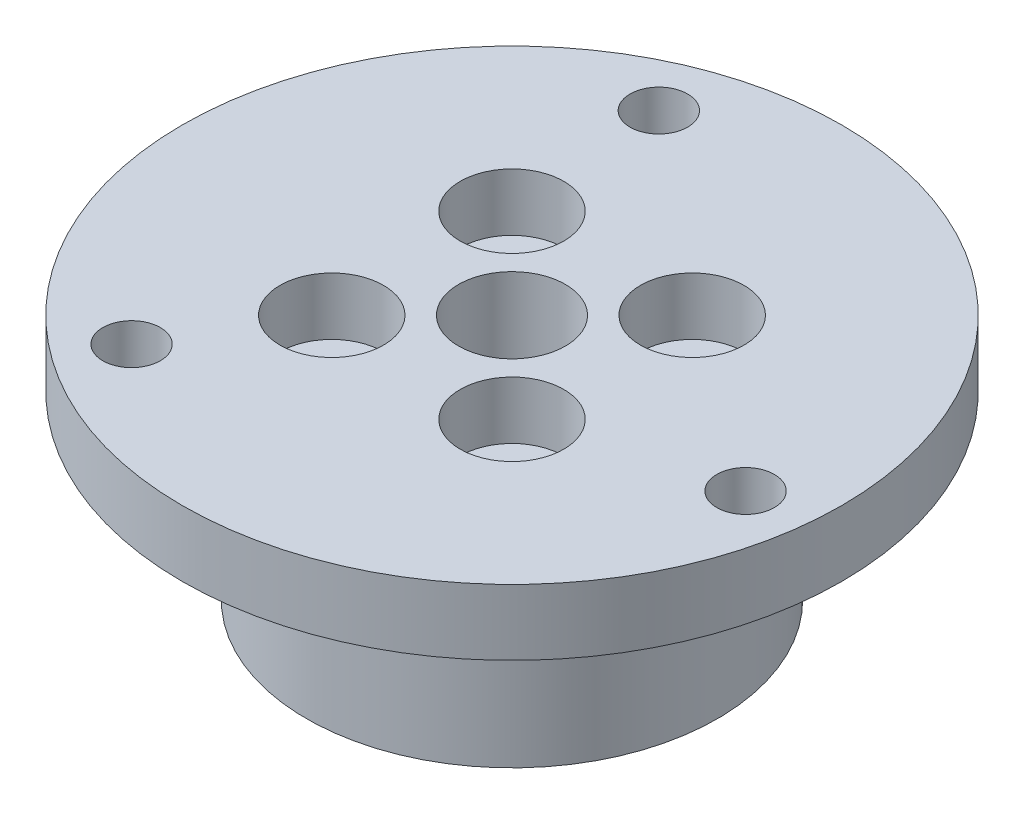
ISO-10303-21;
HEADER;
FILE_DESCRIPTION(('STEP AP214'),'2;1');
FILE_NAME('part.step','',(''),(''),'','','');
FILE_SCHEMA(('AUTOMOTIVE_DESIGN { 1 0 10303 214 1 1 1 1 }'));
ENDSEC;
DATA;
#1=APPLICATION_CONTEXT('core data for automotive mechanical design processes');
#2=APPLICATION_PROTOCOL_DEFINITION('international standard','automotive_design',2000,#1);
#3=PRODUCT_CONTEXT('',#1,'mechanical');
#4=PRODUCT('Part','Part','',(#3));
#5=PRODUCT_RELATED_PRODUCT_CATEGORY('part','',(#4));
#6=PRODUCT_DEFINITION_FORMATION('','',#4);
#7=PRODUCT_DEFINITION_CONTEXT('part definition',#1,'design');
#8=PRODUCT_DEFINITION('design','',#6,#7);
#9=PRODUCT_DEFINITION_SHAPE('','',#8);
#10=(LENGTH_UNIT() NAMED_UNIT(*) SI_UNIT(.MILLI.,.METRE.));
#11=(NAMED_UNIT(*) PLANE_ANGLE_UNIT() SI_UNIT($,.RADIAN.));
#12=(NAMED_UNIT(*) SI_UNIT($,.STERADIAN.) SOLID_ANGLE_UNIT());
#13=UNCERTAINTY_MEASURE_WITH_UNIT(LENGTH_MEASURE(1.E-05),#10,'distance_accuracy_value','');
#14=(GEOMETRIC_REPRESENTATION_CONTEXT(3) GLOBAL_UNCERTAINTY_ASSIGNED_CONTEXT((#13)) GLOBAL_UNIT_ASSIGNED_CONTEXT((#10,
#11,#12)) REPRESENTATION_CONTEXT('',''));
#15=CARTESIAN_POINT('',(0.,0.,0.));
#16=DIRECTION('',(0.,0.,1.));
#17=DIRECTION('',(1.,0.,0.));
#18=AXIS2_PLACEMENT_3D('',#15,#16,#17);
#19=CARTESIAN_POINT('',(16.3588402126679,15.,2.15368217163084));
#20=DIRECTION('',(0.,-1.,0.));
#21=DIRECTION('',(0.,0.,-1.));
#22=AXIS2_PLACEMENT_3D('',#19,#20,#21);
#23=CYLINDRICAL_SURFACE('',#22,1.75);
#24=CARTESIAN_POINT('',(16.3588402126679,15.,2.15368217163084));
#25=DIRECTION('',(0.,1.,0.));
#26=DIRECTION('',(0.,0.,1.));
#27=AXIS2_PLACEMENT_3D('',#24,#25,#26);
#28=CIRCLE('',#27,1.75);
#29=CARTESIAN_POINT('',(16.3588402126679,15.,3.90368217163084));
#30=VERTEX_POINT('',#29);
#31=EDGE_CURVE('E50',#30,#30,#28,.T.);
#32=ORIENTED_EDGE('',*,*,#31,.T.);
#33=EDGE_LOOP('',(#32));
#34=FACE_BOUND('',#33,.T.);
#35=CARTESIAN_POINT('',(16.3588402126679,11.,2.15368217163084));
#36=DIRECTION('',(0.,-1.,0.));
#37=DIRECTION('',(0.,0.,-1.));
#38=AXIS2_PLACEMENT_3D('',#35,#36,#37);
#39=CIRCLE('',#38,1.75);
#40=CARTESIAN_POINT('',(16.3588402126679,11.,0.403682171630836));
#41=VERTEX_POINT('',#40);
#42=EDGE_CURVE('E145',#41,#41,#39,.T.);
#43=ORIENTED_EDGE('',*,*,#42,.T.);
#44=EDGE_LOOP('',(#43));
#45=FACE_BOUND('',#44,.T.);
#46=ADVANCED_FACE('F41',(#34,#45),#23,.F.);
#47=CARTESIAN_POINT('',(-6.314276634024,15.,-15.2440122864362));
#48=DIRECTION('',(0.,-1.,0.));
#49=DIRECTION('',(0.,0.,-1.));
#50=AXIS2_PLACEMENT_3D('',#47,#48,#49);
#51=CYLINDRICAL_SURFACE('',#50,1.75);
#52=CARTESIAN_POINT('',(-6.314276634024,15.,-15.2440122864362));
#53=DIRECTION('',(0.,1.,0.));
#54=DIRECTION('',(0.,0.,1.));
#55=AXIS2_PLACEMENT_3D('',#52,#53,#54);
#56=CIRCLE('',#55,1.75);
#57=CARTESIAN_POINT('',(-6.314276634024,15.,-13.4940122864362));
#58=VERTEX_POINT('',#57);
#59=EDGE_CURVE('E56',#58,#58,#56,.T.);
#60=ORIENTED_EDGE('',*,*,#59,.T.);
#61=EDGE_LOOP('',(#60));
#62=FACE_BOUND('',#61,.T.);
#63=CARTESIAN_POINT('',(-6.314276634024,11.,-15.2440122864362));
#64=DIRECTION('',(0.,-1.,0.));
#65=DIRECTION('',(0.,0.,-1.));
#66=AXIS2_PLACEMENT_3D('',#63,#64,#65);
#67=CIRCLE('',#66,1.75);
#68=CARTESIAN_POINT('',(-6.314276634024,11.,-16.9940122864362));
#69=VERTEX_POINT('',#68);
#70=EDGE_CURVE('E148',#69,#69,#67,.T.);
#71=ORIENTED_EDGE('',*,*,#70,.T.);
#72=EDGE_LOOP('',(#71));
#73=FACE_BOUND('',#72,.T.);
#74=ADVANCED_FACE('F130',(#62,#73),#51,.F.);
#75=CARTESIAN_POINT('',(-10.0445635786439,15.,13.0903301148054));
#76=DIRECTION('',(0.,-1.,0.));
#77=DIRECTION('',(0.,0.,-1.));
#78=AXIS2_PLACEMENT_3D('',#75,#76,#77);
#79=CYLINDRICAL_SURFACE('',#78,1.75);
#80=CARTESIAN_POINT('',(-10.0445635786439,15.,13.0903301148054));
#81=DIRECTION('',(0.,1.,0.));
#82=DIRECTION('',(0.,0.,1.));
#83=AXIS2_PLACEMENT_3D('',#80,#81,#82);
#84=CIRCLE('',#83,1.75);
#85=CARTESIAN_POINT('',(-10.0445635786439,15.,14.8403301148054));
#86=VERTEX_POINT('',#85);
#87=EDGE_CURVE('E123',#86,#86,#84,.T.);
#88=ORIENTED_EDGE('',*,*,#87,.T.);
#89=EDGE_LOOP('',(#88));
#90=FACE_BOUND('',#89,.T.);
#91=CARTESIAN_POINT('',(-10.0445635786439,11.,13.0903301148054));
#92=DIRECTION('',(0.,-1.,0.));
#93=DIRECTION('',(0.,0.,-1.));
#94=AXIS2_PLACEMENT_3D('',#91,#92,#93);
#95=CIRCLE('',#94,1.75);
#96=CARTESIAN_POINT('',(-10.0445635786439,11.,11.3403301148054));
#97=VERTEX_POINT('',#96);
#98=EDGE_CURVE('E155',#97,#97,#95,.T.);
#99=ORIENTED_EDGE('',*,*,#98,.T.);
#100=EDGE_LOOP('',(#99));
#101=FACE_BOUND('',#100,.T.);
#102=ADVANCED_FACE('F196',(#90,#101),#79,.F.);
#103=CARTESIAN_POINT('',(0.,15.,0.));
#104=DIRECTION('',(0.,-1.,0.));
#105=DIRECTION('',(0.,0.,-1.));
#106=AXIS2_PLACEMENT_3D('',#103,#104,#105);
#107=CYLINDRICAL_SURFACE('',#106,20.05);
#108=CARTESIAN_POINT('',(0.,15.,0.));
#109=DIRECTION('',(0.,1.,0.));
#110=DIRECTION('',(0.,0.,1.));
#111=AXIS2_PLACEMENT_3D('',#108,#109,#110);
#112=CIRCLE('',#111,20.05);
#113=CARTESIAN_POINT('',(0.,15.,20.05));
#114=VERTEX_POINT('',#113);
#115=EDGE_CURVE('E10',#114,#114,#112,.T.);
#116=ORIENTED_EDGE('',*,*,#115,.F.);
#117=EDGE_LOOP('',(#116));
#118=FACE_BOUND('',#117,.T.);
#119=CARTESIAN_POINT('',(0.,11.,0.));
#120=DIRECTION('',(0.,-1.,0.));
#121=DIRECTION('',(0.,0.,-1.));
#122=AXIS2_PLACEMENT_3D('',#119,#120,#121);
#123=CIRCLE('',#122,20.05);
#124=CARTESIAN_POINT('',(0.,11.,-20.05));
#125=VERTEX_POINT('',#124);
#126=EDGE_CURVE('E205',#125,#125,#123,.T.);
#127=ORIENTED_EDGE('',*,*,#126,.F.);
#128=EDGE_LOOP('',(#127));
#129=FACE_BOUND('',#128,.T.);
#130=ADVANCED_FACE('F199',(#118,#129),#107,.T.);
#131=CARTESIAN_POINT('',(0.,0.,0.));
#132=DIRECTION('',(0.,1.,0.));
#133=DIRECTION('',(0.,0.,1.));
#134=AXIS2_PLACEMENT_3D('',#131,#132,#133);
#135=PLANE('',#134);
#136=CARTESIAN_POINT('',(-5.48007755419575,0.,-5.48007755419574));
#137=DIRECTION('',(0.,1.,0.));
#138=DIRECTION('',(0.,0.,1.));
#139=AXIS2_PLACEMENT_3D('',#136,#137,#138);
#140=CIRCLE('',#139,1.75);
#141=CARTESIAN_POINT('',(-5.48007755419575,0.,-3.73007755419574));
#142=VERTEX_POINT('',#141);
#143=EDGE_CURVE('E76',#142,#142,#140,.T.);
#144=ORIENTED_EDGE('',*,*,#143,.T.);
#145=EDGE_LOOP('',(#144));
#146=FACE_BOUND('',#145,.T.);
#147=CARTESIAN_POINT('',(-5.48007755419574,0.,5.48007755419574));
#148=DIRECTION('',(0.,1.,0.));
#149=DIRECTION('',(0.,0.,1.));
#150=AXIS2_PLACEMENT_3D('',#147,#148,#149);
#151=CIRCLE('',#150,1.75);
#152=CARTESIAN_POINT('',(-5.48007755419574,0.,7.23007755419574));
#153=VERTEX_POINT('',#152);
#154=EDGE_CURVE('E72',#153,#153,#151,.T.);
#155=ORIENTED_EDGE('',*,*,#154,.T.);
#156=EDGE_LOOP('',(#155));
#157=FACE_BOUND('',#156,.T.);
#158=CARTESIAN_POINT('',(5.48007755419575,0.,5.48007755419575));
#159=DIRECTION('',(0.,1.,0.));
#160=DIRECTION('',(0.,0.,1.));
#161=AXIS2_PLACEMENT_3D('',#158,#159,#160);
#162=CIRCLE('',#161,1.75);
#163=CARTESIAN_POINT('',(5.48007755419575,0.,7.23007755419575));
#164=VERTEX_POINT('',#163);
#165=EDGE_CURVE('E68',#164,#164,#162,.T.);
#166=ORIENTED_EDGE('',*,*,#165,.T.);
#167=EDGE_LOOP('',(#166));
#168=FACE_BOUND('',#167,.T.);
#169=CARTESIAN_POINT('',(5.48007755419575,0.,-5.48007755419574));
#170=DIRECTION('',(0.,1.,0.));
#171=DIRECTION('',(0.,0.,1.));
#172=AXIS2_PLACEMENT_3D('',#169,#170,#171);
#173=CIRCLE('',#172,1.75);
#174=CARTESIAN_POINT('',(5.48007755419575,0.,-3.73007755419574));
#175=VERTEX_POINT('',#174);
#176=EDGE_CURVE('E64',#175,#175,#173,.T.);
#177=ORIENTED_EDGE('',*,*,#176,.T.);
#178=EDGE_LOOP('',(#177));
#179=FACE_BOUND('',#178,.T.);
#180=CARTESIAN_POINT('',(0.,0.,0.));
#181=DIRECTION('',(0.,1.,0.));
#182=DIRECTION('',(0.,0.,1.));
#183=AXIS2_PLACEMENT_3D('',#180,#181,#182);
#184=CIRCLE('',#183,3.25);
#185=CARTESIAN_POINT('',(0.,0.,3.25));
#186=VERTEX_POINT('',#185);
#187=EDGE_CURVE('E60',#186,#186,#184,.T.);
#188=ORIENTED_EDGE('',*,*,#187,.T.);
#189=EDGE_LOOP('',(#188));
#190=FACE_BOUND('',#189,.T.);
#191=CARTESIAN_POINT('',(0.,0.,0.));
#192=DIRECTION('',(0.,-1.,0.));
#193=DIRECTION('',(0.,0.,-1.));
#194=AXIS2_PLACEMENT_3D('',#191,#192,#193);
#195=CIRCLE('',#194,12.5);
#196=CARTESIAN_POINT('',(0.,0.,-12.5));
#197=VERTEX_POINT('',#196);
#198=EDGE_CURVE('E211',#197,#197,#195,.T.);
#199=ORIENTED_EDGE('',*,*,#198,.T.);
#200=EDGE_LOOP('',(#199));
#201=FACE_BOUND('',#200,.T.);
#202=ADVANCED_FACE('F229',(#146,#157,#168,#179,#190,#201),#135,.F.);
#203=CARTESIAN_POINT('',(-5.48007755419575,15.,-5.48007755419574));
#204=DIRECTION('',(0.,-1.,0.));
#205=DIRECTION('',(0.,0.,-1.));
#206=AXIS2_PLACEMENT_3D('',#203,#204,#205);
#207=CYLINDRICAL_SURFACE('',#206,1.75);
#208=ORIENTED_EDGE('',*,*,#143,.F.);
#209=EDGE_LOOP('',(#208));
#210=FACE_BOUND('',#209,.T.);
#211=CARTESIAN_POINT('',(-5.48007755419575,11.5,-5.48007755419574));
#212=DIRECTION('',(0.,1.,0.));
#213=DIRECTION('',(0.,0.,1.));
#214=AXIS2_PLACEMENT_3D('',#211,#212,#213);
#215=CIRCLE('',#214,1.75);
#216=CARTESIAN_POINT('',(-5.48007755419575,11.5,-3.73007755419574));
#217=VERTEX_POINT('',#216);
#218=EDGE_CURVE('E45',#217,#217,#215,.T.);
#219=ORIENTED_EDGE('',*,*,#218,.T.);
#220=EDGE_LOOP('',(#219));
#221=FACE_BOUND('',#220,.T.);
#222=ADVANCED_FACE('F98',(#210,#221),#207,.F.);
#223=CARTESIAN_POINT('',(-5.48007755419574,15.,5.48007755419574));
#224=DIRECTION('',(0.,-1.,0.));
#225=DIRECTION('',(0.,0.,-1.));
#226=AXIS2_PLACEMENT_3D('',#223,#224,#225);
#227=CYLINDRICAL_SURFACE('',#226,1.75);
#228=ORIENTED_EDGE('',*,*,#154,.F.);
#229=EDGE_LOOP('',(#228));
#230=FACE_BOUND('',#229,.T.);
#231=CARTESIAN_POINT('',(-5.48007755419574,11.5,5.48007755419574));
#232=DIRECTION('',(0.,1.,0.));
#233=DIRECTION('',(0.,0.,1.));
#234=AXIS2_PLACEMENT_3D('',#231,#232,#233);
#235=CIRCLE('',#234,1.75);
#236=CARTESIAN_POINT('',(-5.48007755419574,11.5,7.23007755419574));
#237=VERTEX_POINT('',#236);
#238=EDGE_CURVE('E89',#237,#237,#235,.T.);
#239=ORIENTED_EDGE('',*,*,#238,.T.);
#240=EDGE_LOOP('',(#239));
#241=FACE_BOUND('',#240,.T.);
#242=ADVANCED_FACE('F242',(#230,#241),#227,.F.);
#243=CARTESIAN_POINT('',(5.48007755419575,15.,5.48007755419575));
#244=DIRECTION('',(0.,-1.,0.));
#245=DIRECTION('',(0.,0.,-1.));
#246=AXIS2_PLACEMENT_3D('',#243,#244,#245);
#247=CYLINDRICAL_SURFACE('',#246,1.75);
#248=ORIENTED_EDGE('',*,*,#165,.F.);
#249=EDGE_LOOP('',(#248));
#250=FACE_BOUND('',#249,.T.);
#251=CARTESIAN_POINT('',(5.48007755419575,11.5,5.48007755419575));
#252=DIRECTION('',(0.,1.,0.));
#253=DIRECTION('',(0.,0.,1.));
#254=AXIS2_PLACEMENT_3D('',#251,#252,#253);
#255=CIRCLE('',#254,1.75);
#256=CARTESIAN_POINT('',(5.48007755419575,11.5,7.23007755419575));
#257=VERTEX_POINT('',#256);
#258=EDGE_CURVE('E85',#257,#257,#255,.T.);
#259=ORIENTED_EDGE('',*,*,#258,.T.);
#260=EDGE_LOOP('',(#259));
#261=FACE_BOUND('',#260,.T.);
#262=ADVANCED_FACE('F246',(#250,#261),#247,.F.);
#263=CARTESIAN_POINT('',(5.48007755419575,15.,-5.48007755419574));
#264=DIRECTION('',(0.,-1.,0.));
#265=DIRECTION('',(0.,0.,-1.));
#266=AXIS2_PLACEMENT_3D('',#263,#264,#265);
#267=CYLINDRICAL_SURFACE('',#266,1.75);
#268=ORIENTED_EDGE('',*,*,#176,.F.);
#269=EDGE_LOOP('',(#268));
#270=FACE_BOUND('',#269,.T.);
#271=CARTESIAN_POINT('',(5.48007755419575,11.5,-5.48007755419574));
#272=DIRECTION('',(0.,1.,0.));
#273=DIRECTION('',(0.,0.,1.));
#274=AXIS2_PLACEMENT_3D('',#271,#272,#273);
#275=CIRCLE('',#274,1.75);
#276=CARTESIAN_POINT('',(5.48007755419575,11.5,-3.73007755419574));
#277=VERTEX_POINT('',#276);
#278=EDGE_CURVE('E81',#277,#277,#275,.T.);
#279=ORIENTED_EDGE('',*,*,#278,.T.);
#280=EDGE_LOOP('',(#279));
#281=FACE_BOUND('',#280,.T.);
#282=ADVANCED_FACE('F249',(#270,#281),#267,.F.);
#283=CARTESIAN_POINT('',(0.,15.,0.));
#284=DIRECTION('',(0.,-1.,0.));
#285=DIRECTION('',(0.,0.,-1.));
#286=AXIS2_PLACEMENT_3D('',#283,#284,#285);
#287=CYLINDRICAL_SURFACE('',#286,3.25);
#288=CARTESIAN_POINT('',(0.,15.,0.));
#289=DIRECTION('',(0.,1.,0.));
#290=DIRECTION('',(0.,0.,1.));
#291=AXIS2_PLACEMENT_3D('',#288,#289,#290);
#292=CIRCLE('',#291,3.25);
#293=CARTESIAN_POINT('',(0.,15.,3.25));
#294=VERTEX_POINT('',#293);
#295=EDGE_CURVE('E80',#294,#294,#292,.T.);
#296=ORIENTED_EDGE('',*,*,#295,.T.);
#297=EDGE_LOOP('',(#296));
#298=FACE_BOUND('',#297,.T.);
#299=ORIENTED_EDGE('',*,*,#187,.F.);
#300=EDGE_LOOP('',(#299));
#301=FACE_BOUND('',#300,.T.);
#302=ADVANCED_FACE('F43',(#298,#301),#287,.F.);
#303=CARTESIAN_POINT('',(0.,15.,0.));
#304=DIRECTION('',(0.,1.,0.));
#305=DIRECTION('',(0.,0.,1.));
#306=AXIS2_PLACEMENT_3D('',#303,#304,#305);
#307=PLANE('',#306);
#308=CARTESIAN_POINT('',(-5.48007755419574,15.,5.48007755419574));
#309=DIRECTION('',(0.,1.,0.));
#310=DIRECTION('',(0.,0.,1.));
#311=AXIS2_PLACEMENT_3D('',#308,#309,#310);
#312=CIRCLE('',#311,3.15);
#313=CARTESIAN_POINT('',(-5.48007755419574,15.,8.63007755419575));
#314=VERTEX_POINT('',#313);
#315=EDGE_CURVE('E117',#314,#314,#312,.T.);
#316=ORIENTED_EDGE('',*,*,#315,.F.);
#317=EDGE_LOOP('',(#316));
#318=FACE_BOUND('',#317,.T.);
#319=CARTESIAN_POINT('',(5.48007755419575,15.,5.48007755419575));
#320=DIRECTION('',(0.,1.,0.));
#321=DIRECTION('',(0.,0.,1.));
#322=AXIS2_PLACEMENT_3D('',#319,#320,#321);
#323=CIRCLE('',#322,3.15);
#324=CARTESIAN_POINT('',(5.48007755419575,15.,8.63007755419575));
#325=VERTEX_POINT('',#324);
#326=EDGE_CURVE('E170',#325,#325,#323,.T.);
#327=ORIENTED_EDGE('',*,*,#326,.F.);
#328=EDGE_LOOP('',(#327));
#329=FACE_BOUND('',#328,.T.);
#330=CARTESIAN_POINT('',(5.48007755419575,15.,-5.48007755419574));
#331=DIRECTION('',(0.,1.,0.));
#332=DIRECTION('',(0.,0.,1.));
#333=AXIS2_PLACEMENT_3D('',#330,#331,#332);
#334=CIRCLE('',#333,3.15);
#335=CARTESIAN_POINT('',(5.48007755419575,15.,-2.33007755419575));
#336=VERTEX_POINT('',#335);
#337=EDGE_CURVE('E162',#336,#336,#334,.T.);
#338=ORIENTED_EDGE('',*,*,#337,.F.);
#339=EDGE_LOOP('',(#338));
#340=FACE_BOUND('',#339,.T.);
#341=CARTESIAN_POINT('',(-5.48007755419575,15.,-5.48007755419574));
#342=DIRECTION('',(0.,1.,0.));
#343=DIRECTION('',(0.,0.,1.));
#344=AXIS2_PLACEMENT_3D('',#341,#342,#343);
#345=CIRCLE('',#344,3.15);
#346=CARTESIAN_POINT('',(-5.48007755419575,15.,-2.33007755419574));
#347=VERTEX_POINT('',#346);
#348=EDGE_CURVE('E110',#347,#347,#345,.T.);
#349=ORIENTED_EDGE('',*,*,#348,.F.);
#350=EDGE_LOOP('',(#349));
#351=FACE_BOUND('',#350,.T.);
#352=ORIENTED_EDGE('',*,*,#295,.F.);
#353=EDGE_LOOP('',(#352));
#354=FACE_BOUND('',#353,.T.);
#355=ORIENTED_EDGE('',*,*,#87,.F.);
#356=EDGE_LOOP('',(#355));
#357=FACE_BOUND('',#356,.T.);
#358=ORIENTED_EDGE('',*,*,#59,.F.);
#359=EDGE_LOOP('',(#358));
#360=FACE_BOUND('',#359,.T.);
#361=ORIENTED_EDGE('',*,*,#31,.F.);
#362=EDGE_LOOP('',(#361));
#363=FACE_BOUND('',#362,.T.);
#364=ORIENTED_EDGE('',*,*,#115,.T.);
#365=EDGE_LOOP('',(#364));
#366=FACE_BOUND('',#365,.T.);
#367=ADVANCED_FACE('F133',(#318,#329,#340,#351,#354,#357,#360,#363,#366),#307,.T.);
#368=CARTESIAN_POINT('',(-5.48007755419575,11.5,-5.48007755419574));
#369=DIRECTION('',(0.,1.,0.));
#370=DIRECTION('',(0.,0.,1.));
#371=AXIS2_PLACEMENT_3D('',#368,#369,#370);
#372=CYLINDRICAL_SURFACE('',#371,3.15);
#373=CARTESIAN_POINT('',(-5.48007755419575,11.5,-5.48007755419574));
#374=DIRECTION('',(0.,1.,0.));
#375=DIRECTION('',(0.,0.,1.));
#376=AXIS2_PLACEMENT_3D('',#373,#374,#375);
#377=CIRCLE('',#376,3.15);
#378=CARTESIAN_POINT('',(-5.48007755419575,11.5,-2.33007755419574));
#379=VERTEX_POINT('',#378);
#380=EDGE_CURVE('E86',#379,#379,#377,.T.);
#381=ORIENTED_EDGE('',*,*,#380,.F.);
#382=EDGE_LOOP('',(#381));
#383=FACE_BOUND('',#382,.T.);
#384=ORIENTED_EDGE('',*,*,#348,.T.);
#385=EDGE_LOOP('',(#384));
#386=FACE_BOUND('',#385,.T.);
#387=ADVANCED_FACE('F104',(#383,#386),#372,.F.);
#388=CARTESIAN_POINT('',(-5.48007755419575,11.5,-5.48007755419574));
#389=DIRECTION('',(0.,1.,0.));
#390=DIRECTION('',(0.,0.,1.));
#391=AXIS2_PLACEMENT_3D('',#388,#389,#390);
#392=PLANE('',#391);
#393=ORIENTED_EDGE('',*,*,#218,.F.);
#394=EDGE_LOOP('',(#393));
#395=FACE_BOUND('',#394,.T.);
#396=ORIENTED_EDGE('',*,*,#380,.T.);
#397=EDGE_LOOP('',(#396));
#398=FACE_BOUND('',#397,.T.);
#399=ADVANCED_FACE('F100',(#395,#398),#392,.T.);
#400=CARTESIAN_POINT('',(5.48007755419575,11.5,-5.48007755419574));
#401=DIRECTION('',(0.,1.,0.));
#402=DIRECTION('',(0.,0.,1.));
#403=AXIS2_PLACEMENT_3D('',#400,#401,#402);
#404=CYLINDRICAL_SURFACE('',#403,3.15);
#405=CARTESIAN_POINT('',(5.48007755419575,11.5,-5.48007755419574));
#406=DIRECTION('',(0.,1.,0.));
#407=DIRECTION('',(0.,0.,1.));
#408=AXIS2_PLACEMENT_3D('',#405,#406,#407);
#409=CIRCLE('',#408,3.15);
#410=CARTESIAN_POINT('',(5.48007755419575,11.5,-2.33007755419575));
#411=VERTEX_POINT('',#410);
#412=EDGE_CURVE('E114',#411,#411,#409,.T.);
#413=ORIENTED_EDGE('',*,*,#412,.F.);
#414=EDGE_LOOP('',(#413));
#415=FACE_BOUND('',#414,.T.);
#416=ORIENTED_EDGE('',*,*,#337,.T.);
#417=EDGE_LOOP('',(#416));
#418=FACE_BOUND('',#417,.T.);
#419=ADVANCED_FACE('F103',(#415,#418),#404,.F.);
#420=CARTESIAN_POINT('',(5.48007755419575,11.5,-5.48007755419574));
#421=DIRECTION('',(0.,1.,0.));
#422=DIRECTION('',(0.,0.,1.));
#423=AXIS2_PLACEMENT_3D('',#420,#421,#422);
#424=PLANE('',#423);
#425=ORIENTED_EDGE('',*,*,#278,.F.);
#426=EDGE_LOOP('',(#425));
#427=FACE_BOUND('',#426,.T.);
#428=ORIENTED_EDGE('',*,*,#412,.T.);
#429=EDGE_LOOP('',(#428));
#430=FACE_BOUND('',#429,.T.);
#431=ADVANCED_FACE('F261',(#427,#430),#424,.T.);
#432=CARTESIAN_POINT('',(5.48007755419575,11.5,5.48007755419575));
#433=DIRECTION('',(0.,1.,0.));
#434=DIRECTION('',(0.,0.,1.));
#435=AXIS2_PLACEMENT_3D('',#432,#433,#434);
#436=CYLINDRICAL_SURFACE('',#435,3.15);
#437=CARTESIAN_POINT('',(5.48007755419575,11.5,5.48007755419575));
#438=DIRECTION('',(0.,1.,0.));
#439=DIRECTION('',(0.,0.,1.));
#440=AXIS2_PLACEMENT_3D('',#437,#438,#439);
#441=CIRCLE('',#440,3.15);
#442=CARTESIAN_POINT('',(5.48007755419575,11.5,8.63007755419575));
#443=VERTEX_POINT('',#442);
#444=EDGE_CURVE('E166',#443,#443,#441,.T.);
#445=ORIENTED_EDGE('',*,*,#444,.F.);
#446=EDGE_LOOP('',(#445));
#447=FACE_BOUND('',#446,.T.);
#448=ORIENTED_EDGE('',*,*,#326,.T.);
#449=EDGE_LOOP('',(#448));
#450=FACE_BOUND('',#449,.T.);
#451=ADVANCED_FACE('F264',(#447,#450),#436,.F.);
#452=CARTESIAN_POINT('',(5.48007755419575,11.5,5.48007755419575));
#453=DIRECTION('',(0.,1.,0.));
#454=DIRECTION('',(0.,0.,1.));
#455=AXIS2_PLACEMENT_3D('',#452,#453,#454);
#456=PLANE('',#455);
#457=ORIENTED_EDGE('',*,*,#258,.F.);
#458=EDGE_LOOP('',(#457));
#459=FACE_BOUND('',#458,.T.);
#460=ORIENTED_EDGE('',*,*,#444,.T.);
#461=EDGE_LOOP('',(#460));
#462=FACE_BOUND('',#461,.T.);
#463=ADVANCED_FACE('F182',(#459,#462),#456,.T.);
#464=CARTESIAN_POINT('',(-5.48007755419574,11.5,5.48007755419574));
#465=DIRECTION('',(0.,1.,0.));
#466=DIRECTION('',(0.,0.,1.));
#467=AXIS2_PLACEMENT_3D('',#464,#465,#466);
#468=CYLINDRICAL_SURFACE('',#467,3.15);
#469=CARTESIAN_POINT('',(-5.48007755419574,11.5,5.48007755419574));
#470=DIRECTION('',(0.,1.,0.));
#471=DIRECTION('',(0.,0.,1.));
#472=AXIS2_PLACEMENT_3D('',#469,#470,#471);
#473=CIRCLE('',#472,3.15);
#474=CARTESIAN_POINT('',(-5.48007755419574,11.5,8.63007755419575));
#475=VERTEX_POINT('',#474);
#476=EDGE_CURVE('E153',#475,#475,#473,.T.);
#477=ORIENTED_EDGE('',*,*,#476,.F.);
#478=EDGE_LOOP('',(#477));
#479=FACE_BOUND('',#478,.T.);
#480=ORIENTED_EDGE('',*,*,#315,.T.);
#481=EDGE_LOOP('',(#480));
#482=FACE_BOUND('',#481,.T.);
#483=ADVANCED_FACE('F179',(#479,#482),#468,.F.);
#484=CARTESIAN_POINT('',(-5.48007755419574,11.5,5.48007755419574));
#485=DIRECTION('',(0.,1.,0.));
#486=DIRECTION('',(0.,0.,1.));
#487=AXIS2_PLACEMENT_3D('',#484,#485,#486);
#488=PLANE('',#487);
#489=ORIENTED_EDGE('',*,*,#238,.F.);
#490=EDGE_LOOP('',(#489));
#491=FACE_BOUND('',#490,.T.);
#492=ORIENTED_EDGE('',*,*,#476,.T.);
#493=EDGE_LOOP('',(#492));
#494=FACE_BOUND('',#493,.T.);
#495=ADVANCED_FACE('F177',(#491,#494),#488,.T.);
#496=CARTESIAN_POINT('',(0.,11.,0.));
#497=DIRECTION('',(0.,-1.,0.));
#498=DIRECTION('',(0.,0.,-1.));
#499=AXIS2_PLACEMENT_3D('',#496,#497,#498);
#500=PLANE('',#499);
#501=ORIENTED_EDGE('',*,*,#42,.F.);
#502=EDGE_LOOP('',(#501));
#503=FACE_BOUND('',#502,.T.);
#504=ORIENTED_EDGE('',*,*,#70,.F.);
#505=EDGE_LOOP('',(#504));
#506=FACE_BOUND('',#505,.T.);
#507=ORIENTED_EDGE('',*,*,#98,.F.);
#508=EDGE_LOOP('',(#507));
#509=FACE_BOUND('',#508,.T.);
#510=CARTESIAN_POINT('',(0.,11.,0.));
#511=DIRECTION('',(0.,-1.,0.));
#512=DIRECTION('',(0.,0.,-1.));
#513=AXIS2_PLACEMENT_3D('',#510,#511,#512);
#514=CIRCLE('',#513,12.5);
#515=CARTESIAN_POINT('',(0.,11.,-12.5));
#516=VERTEX_POINT('',#515);
#517=EDGE_CURVE('E208',#516,#516,#514,.T.);
#518=ORIENTED_EDGE('',*,*,#517,.F.);
#519=EDGE_LOOP('',(#518));
#520=FACE_BOUND('',#519,.T.);
#521=ORIENTED_EDGE('',*,*,#126,.T.);
#522=EDGE_LOOP('',(#521));
#523=FACE_BOUND('',#522,.T.);
#524=ADVANCED_FACE('F222',(#503,#506,#509,#520,#523),#500,.T.);
#525=CARTESIAN_POINT('',(0.,11.,0.));
#526=DIRECTION('',(0.,-1.,0.));
#527=DIRECTION('',(0.,0.,-1.));
#528=AXIS2_PLACEMENT_3D('',#525,#526,#527);
#529=CYLINDRICAL_SURFACE('',#528,12.5);
#530=ORIENTED_EDGE('',*,*,#517,.T.);
#531=EDGE_LOOP('',(#530));
#532=FACE_BOUND('',#531,.T.);
#533=ORIENTED_EDGE('',*,*,#198,.F.);
#534=EDGE_LOOP('',(#533));
#535=FACE_BOUND('',#534,.T.);
#536=ADVANCED_FACE('F219',(#532,#535),#529,.T.);
#537=CLOSED_SHELL('',(#46,#74,#102,#130,#202,#222,#242,#262,#282,#302,#367,#387,#399,#419,#431,
#451,#463,#483,#495,#524,#536));
#538=MANIFOLD_SOLID_BREP('B2',#537);
#539=ADVANCED_BREP_SHAPE_REPRESENTATION('',(#18,#538),#14);
#540=SHAPE_DEFINITION_REPRESENTATION(#9,#539);
ENDSEC;
END-ISO-10303-21;
